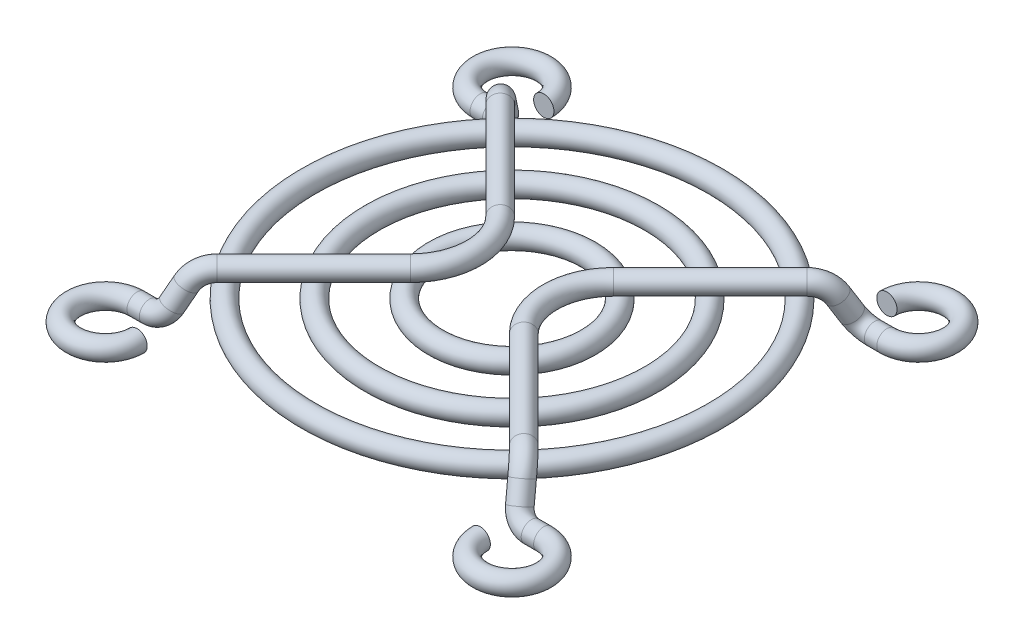
ISO-10303-21;
HEADER;
FILE_DESCRIPTION(('STEP AP214'),'2;1');
FILE_NAME('part.step','',(''),(''),'','','');
FILE_SCHEMA(('AUTOMOTIVE_DESIGN { 1 0 10303 214 1 1 1 1 }'));
ENDSEC;
DATA;
#1=APPLICATION_CONTEXT('core data for automotive mechanical design processes');
#2=APPLICATION_PROTOCOL_DEFINITION('international standard','automotive_design',2000,#1);
#3=PRODUCT_CONTEXT('',#1,'mechanical');
#4=PRODUCT('Part','Part','',(#3));
#5=PRODUCT_RELATED_PRODUCT_CATEGORY('part','',(#4));
#6=PRODUCT_DEFINITION_FORMATION('','',#4);
#7=PRODUCT_DEFINITION_CONTEXT('part definition',#1,'design');
#8=PRODUCT_DEFINITION('design','',#6,#7);
#9=PRODUCT_DEFINITION_SHAPE('','',#8);
#10=(LENGTH_UNIT() NAMED_UNIT(*) SI_UNIT(.MILLI.,.METRE.));
#11=(NAMED_UNIT(*) PLANE_ANGLE_UNIT() SI_UNIT($,.RADIAN.));
#12=(NAMED_UNIT(*) SI_UNIT($,.STERADIAN.) SOLID_ANGLE_UNIT());
#13=UNCERTAINTY_MEASURE_WITH_UNIT(LENGTH_MEASURE(1.E-05),#10,'distance_accuracy_value','');
#14=(GEOMETRIC_REPRESENTATION_CONTEXT(3) GLOBAL_UNCERTAINTY_ASSIGNED_CONTEXT((#13)) GLOBAL_UNIT_ASSIGNED_CONTEXT((#10,
#11,#12)) REPRESENTATION_CONTEXT('',''));
#15=CARTESIAN_POINT('',(0.,0.,0.));
#16=DIRECTION('',(0.,0.,1.));
#17=DIRECTION('',(1.,0.,0.));
#18=AXIS2_PLACEMENT_3D('',#15,#16,#17);
#19=CARTESIAN_POINT('',(16.,-1.6,-16.));
#20=DIRECTION('',(0.,-1.,0.));
#21=DIRECTION('',(0.,0.,-1.));
#22=AXIS2_PLACEMENT_3D('',#19,#20,#21);
#23=TOROIDAL_SURFACE('',#22,2.5,0.799999999999999);
#24=CARTESIAN_POINT('',(13.5,-1.6,-15.9999999999999));
#25=DIRECTION('',(0.,0.,-1.));
#26=DIRECTION('',(-1.,0.,0.));
#27=AXIS2_PLACEMENT_3D('',#24,#25,#26);
#28=CIRCLE('',#27,0.799999999999999);
#29=CARTESIAN_POINT('',(12.7,-1.6,-15.9999999999999));
#30=VERTEX_POINT('',#29);
#31=EDGE_CURVE('E11',#30,#30,#28,.T.);
#32=CARTESIAN_POINT('',(16.,-1.6,-13.5));
#33=DIRECTION('',(-1.,0.,0.));
#34=DIRECTION('',(0.,0.,1.));
#35=AXIS2_PLACEMENT_3D('',#32,#33,#34);
#36=CIRCLE('',#35,0.799999999999999);
#37=CARTESIAN_POINT('',(16.,-1.6,-12.7));
#38=VERTEX_POINT('',#37);
#39=EDGE_CURVE('E49',#38,#38,#36,.T.);
#40=CARTESIAN_POINT('',(16.,-1.6,-16.));
#41=DIRECTION('',(0.,-1.,0.));
#42=DIRECTION('',(0.,0.,-1.));
#43=AXIS2_PLACEMENT_3D('',#40,#41,#42);
#44=CIRCLE('',#43,3.3);
#45=EDGE_CURVE('',#30,#38,#44,.T.);
#46=ORIENTED_EDGE('',*,*,#31,.T.);
#47=ORIENTED_EDGE('',*,*,#39,.F.);
#48=ORIENTED_EDGE('',*,*,#45,.T.);
#49=ORIENTED_EDGE('',*,*,#45,.F.);
#50=EDGE_LOOP('',(#46,#48,#47,#49));
#51=FACE_BOUND('',#50,.T.);
#52=ADVANCED_FACE('F43',(#51),#23,.T.);
#53=CARTESIAN_POINT('',(15.0241205850169,-1.6,-13.5));
#54=DIRECTION('',(1.,0.,0.));
#55=DIRECTION('',(0.,0.,1.));
#56=AXIS2_PLACEMENT_3D('',#53,#54,#55);
#57=CYLINDRICAL_SURFACE('',#56,0.799999999999999);
#58=CARTESIAN_POINT('',(15.0241205850169,-1.6,-13.5));
#59=DIRECTION('',(-1.,0.,0.));
#60=DIRECTION('',(0.,0.,1.));
#61=AXIS2_PLACEMENT_3D('',#58,#59,#60);
#62=CIRCLE('',#61,0.799999999999999);
#63=CARTESIAN_POINT('',(15.0241205850169,-2.31908639541689,-13.8505920077902));
#64=VERTEX_POINT('',#63);
#65=EDGE_CURVE('E53',#64,#64,#62,.T.);
#66=ORIENTED_EDGE('',*,*,#65,.F.);
#67=EDGE_LOOP('',(#66));
#68=FACE_BOUND('',#67,.T.);
#69=ORIENTED_EDGE('',*,*,#39,.T.);
#70=EDGE_LOOP('',(#69));
#71=FACE_BOUND('',#70,.T.);
#72=ADVANCED_FACE('F111',(#68,#71),#57,.T.);
#73=CARTESIAN_POINT('',(15.0241205850169,-0.341598808020452,-12.8864639863672));
#74=DIRECTION('',(0.,0.43824000973773,-0.898857994271105));
#75=DIRECTION('',(0.,0.898857994271105,0.43824000973773));
#76=AXIS2_PLACEMENT_3D('',#73,#74,#75);
#77=TOROIDAL_SURFACE('',#76,1.4,0.799999999999999);
#78=CARTESIAN_POINT('',(13.6898604009678,-0.722686784194421,-13.0722641900187));
#79=DIRECTION('',(-0.30283504068719,0.856650309192963,0.417661568607395));
#80=DIRECTION('',(0.41766156860738,-0.274624108741221,0.866106467477592));
#81=AXIS2_PLACEMENT_3D('',#78,#79,#80);
#82=CIRCLE('',#81,0.799999999999999);
#83=CARTESIAN_POINT('',(12.9274260100826,-0.940451342008117,-13.1784357349625));
#84=VERTEX_POINT('',#83);
#85=EDGE_CURVE('E57',#84,#84,#82,.T.);
#86=CARTESIAN_POINT('',(15.0241205850169,-0.341598808020452,-12.8864639863672));
#87=DIRECTION('',(0.,0.43824000973773,-0.898857994271105));
#88=DIRECTION('',(0.,0.898857994271105,0.43824000973773));
#89=AXIS2_PLACEMENT_3D('',#86,#87,#88);
#90=CIRCLE('',#89,2.2);
#91=EDGE_CURVE('',#64,#84,#90,.T.);
#92=ORIENTED_EDGE('',*,*,#65,.T.);
#93=ORIENTED_EDGE('',*,*,#85,.F.);
#94=ORIENTED_EDGE('',*,*,#91,.T.);
#95=ORIENTED_EDGE('',*,*,#91,.F.);
#96=EDGE_LOOP('',(#92,#94,#93,#95));
#97=FACE_BOUND('',#96,.T.);
#98=ADVANCED_FACE('F116',(#97),#77,.T.);
#99=CARTESIAN_POINT('',(13.2140349780792,0.62331331775687,-12.416019152932));
#100=DIRECTION('',(0.302835040687196,-0.856650309192966,-0.417661568607382));
#101=DIRECTION('',(0.,0.43824000973773,-0.898857994271105));
#102=AXIS2_PLACEMENT_3D('',#99,#100,#101);
#103=CYLINDRICAL_SURFACE('',#102,0.799999999999999);
#104=CARTESIAN_POINT('',(13.2140349780792,0.62331331775687,-12.416019152932));
#105=DIRECTION('',(-0.30283504068719,0.856650309192963,0.417661568607395));
#106=DIRECTION('',(0.41766156860738,-0.274624108741221,0.866106467477592));
#107=AXIS2_PLACEMENT_3D('',#104,#105,#106);
#108=CIRCLE('',#107,0.799999999999999);
#109=CARTESIAN_POINT('',(13.7279954207643,1.02906926174901,-12.8755915381664));
#110=VERTEX_POINT('',#109);
#111=EDGE_CURVE('E62',#110,#110,#108,.T.);
#112=ORIENTED_EDGE('',*,*,#111,.F.);
#113=EDGE_LOOP('',(#112));
#114=FACE_BOUND('',#113,.T.);
#115=ORIENTED_EDGE('',*,*,#85,.T.);
#116=EDGE_LOOP('',(#115));
#117=FACE_BOUND('',#116,.T.);
#118=ADVANCED_FACE('F121',(#114,#117),#103,.T.);
#119=CARTESIAN_POINT('',(11.9291338713665,-0.391076542223485,-11.2670881898462));
#120=DIRECTION('',(0.703951862433849,-0.0943586283910578,0.703951862433841));
#121=DIRECTION('',(-0.707106781186544,0.,0.707106781186551));
#122=AXIS2_PLACEMENT_3D('',#119,#120,#121);
#123=TOROIDAL_SURFACE('',#122,2.,0.799999999999999);
#124=CARTESIAN_POINT('',(12.0625771233641,1.6,-11.1336449378486));
#125=DIRECTION('',(-0.707106781186535,0.,0.707106781186561));
#126=DIRECTION('',(0.629823043352769,-0.454583180643264,0.629823043352742));
#127=AXIS2_PLACEMENT_3D('',#124,#125,#126);
#128=CIRCLE('',#127,0.799999999999999);
#129=CARTESIAN_POINT('',(12.1159544241631,2.3964306168894,-11.0802676370496));
#130=VERTEX_POINT('',#129);
#131=EDGE_CURVE('E65',#130,#130,#128,.T.);
#132=CARTESIAN_POINT('',(11.9291338713665,-0.391076542223485,-11.2670881898462));
#133=DIRECTION('',(0.703951862433849,-0.0943586283910578,0.703951862433841));
#134=DIRECTION('',(-0.707106781186544,0.,0.707106781186551));
#135=AXIS2_PLACEMENT_3D('',#132,#133,#134);
#136=CIRCLE('',#135,2.8);
#137=EDGE_CURVE('',#110,#130,#136,.T.);
#138=ORIENTED_EDGE('',*,*,#111,.T.);
#139=ORIENTED_EDGE('',*,*,#131,.F.);
#140=ORIENTED_EDGE('',*,*,#137,.T.);
#141=ORIENTED_EDGE('',*,*,#137,.F.);
#142=EDGE_LOOP('',(#138,#140,#139,#141));
#143=FACE_BOUND('',#142,.T.);
#144=ADVANCED_FACE('F128',(#143),#123,.T.);
#145=CARTESIAN_POINT('',(4.46446609275775,1.6,-3.53553390724226));
#146=DIRECTION('',(0.707106781186544,0.,-0.707106781186551));
#147=DIRECTION('',(0.707106781186551,0.,0.707106781186544));
#148=AXIS2_PLACEMENT_3D('',#145,#146,#147);
#149=CYLINDRICAL_SURFACE('',#148,0.799999999999999);
#150=CARTESIAN_POINT('',(4.46446609275775,1.6,-3.53553390724226));
#151=DIRECTION('',(-0.707106781186535,0.,0.707106781186561));
#152=DIRECTION('',(0.629823043352769,-0.454583180643264,0.629823043352742));
#153=AXIS2_PLACEMENT_3D('',#150,#151,#152);
#154=CIRCLE('',#153,0.799999999999999);
#155=CARTESIAN_POINT('',(3.89878066780852,1.6,-4.10121933219149));
#156=VERTEX_POINT('',#155);
#157=EDGE_CURVE('E68',#156,#156,#154,.T.);
#158=ORIENTED_EDGE('',*,*,#157,.F.);
#159=EDGE_LOOP('',(#158));
#160=FACE_BOUND('',#159,.T.);
#161=ORIENTED_EDGE('',*,*,#131,.T.);
#162=EDGE_LOOP('',(#161));
#163=FACE_BOUND('',#162,.T.);
#164=ADVANCED_FACE('F132',(#160,#163),#149,.T.);
#165=CARTESIAN_POINT('',(8.,1.6,0.));
#166=DIRECTION('',(0.,1.,0.));
#167=DIRECTION('',(0.,0.,1.));
#168=AXIS2_PLACEMENT_3D('',#165,#166,#167);
#169=TOROIDAL_SURFACE('',#168,5.00000000185193,0.799999999999999);
#170=CARTESIAN_POINT('',(4.46446609275775,1.6,3.53553390724226));
#171=DIRECTION('',(0.707106781186562,0.,0.707106781186534));
#172=DIRECTION('',(0.629823043352741,-0.454583180643264,-0.62982304335277));
#173=AXIS2_PLACEMENT_3D('',#170,#171,#172);
#174=CIRCLE('',#173,0.799999999999999);
#175=CARTESIAN_POINT('',(3.89878066780852,1.6,4.10121933219149));
#176=VERTEX_POINT('',#175);
#177=EDGE_CURVE('E71',#176,#176,#174,.T.);
#178=CARTESIAN_POINT('',(8.,1.6,0.));
#179=DIRECTION('',(0.,1.,0.));
#180=DIRECTION('',(0.,0.,1.));
#181=AXIS2_PLACEMENT_3D('',#178,#179,#180);
#182=CIRCLE('',#181,5.80000000185193);
#183=EDGE_CURVE('',#156,#176,#182,.T.);
#184=ORIENTED_EDGE('',*,*,#157,.T.);
#185=ORIENTED_EDGE('',*,*,#177,.F.);
#186=ORIENTED_EDGE('',*,*,#183,.T.);
#187=ORIENTED_EDGE('',*,*,#183,.F.);
#188=EDGE_LOOP('',(#184,#186,#185,#187));
#189=FACE_BOUND('',#188,.T.);
#190=ADVANCED_FACE('F136',(#189),#169,.T.);
#191=CARTESIAN_POINT('',(12.0625771233642,1.6,11.1336449378485));
#192=DIRECTION('',(-0.707106781186554,0.,-0.707106781186541));
#193=DIRECTION('',(0.707106781186541,0.,-0.707106781186554));
#194=AXIS2_PLACEMENT_3D('',#191,#192,#193);
#195=CYLINDRICAL_SURFACE('',#194,0.799999999999999);
#196=CARTESIAN_POINT('',(12.0625771233642,1.6,11.1336449378485));
#197=DIRECTION('',(0.707106781186562,0.,0.707106781186534));
#198=DIRECTION('',(0.629823043352741,-0.454583180643264,-0.62982304335277));
#199=AXIS2_PLACEMENT_3D('',#196,#197,#198);
#200=CIRCLE('',#199,0.799999999999999);
#201=CARTESIAN_POINT('',(12.1159544241632,2.39643061688939,11.0802676370495));
#202=VERTEX_POINT('',#201);
#203=EDGE_CURVE('E74',#202,#202,#200,.T.);
#204=ORIENTED_EDGE('',*,*,#203,.F.);
#205=EDGE_LOOP('',(#204));
#206=FACE_BOUND('',#205,.T.);
#207=ORIENTED_EDGE('',*,*,#177,.T.);
#208=EDGE_LOOP('',(#207));
#209=FACE_BOUND('',#208,.T.);
#210=ADVANCED_FACE('F140',(#206,#209),#195,.T.);
#211=CARTESIAN_POINT('',(11.9291338713666,-0.391076542223475,11.2670881898462));
#212=DIRECTION('',(0.703951862433834,-0.0943586283911166,-0.703951862433848));
#213=DIRECTION('',(0.707106781186554,0.,0.707106781186541));
#214=AXIS2_PLACEMENT_3D('',#211,#212,#213);
#215=TOROIDAL_SURFACE('',#214,2.,0.799999999999999);
#216=CARTESIAN_POINT('',(13.2140349780794,0.623313317756879,12.416019152932));
#217=DIRECTION('',(0.302835040687154,-0.856650309192979,0.417661568607388));
#218=DIRECTION('',(0.417661568607394,-0.274624108741218,-0.866106467477586));
#219=AXIS2_PLACEMENT_3D('',#216,#217,#218);
#220=CIRCLE('',#219,0.799999999999999);
#221=CARTESIAN_POINT('',(13.7279954207645,1.02906926174902,12.8755915381663));
#222=VERTEX_POINT('',#221);
#223=EDGE_CURVE('E77',#222,#222,#220,.T.);
#224=CARTESIAN_POINT('',(11.9291338713666,-0.391076542223475,11.2670881898462));
#225=DIRECTION('',(0.703951862433834,-0.0943586283911166,-0.703951862433848));
#226=DIRECTION('',(0.707106781186554,0.,0.707106781186541));
#227=AXIS2_PLACEMENT_3D('',#224,#225,#226);
#228=CIRCLE('',#227,2.8);
#229=EDGE_CURVE('',#202,#222,#228,.T.);
#230=ORIENTED_EDGE('',*,*,#203,.T.);
#231=ORIENTED_EDGE('',*,*,#223,.F.);
#232=ORIENTED_EDGE('',*,*,#229,.T.);
#233=ORIENTED_EDGE('',*,*,#229,.F.);
#234=EDGE_LOOP('',(#230,#232,#231,#233));
#235=FACE_BOUND('',#234,.T.);
#236=ADVANCED_FACE('F144',(#235),#215,.T.);
#237=CARTESIAN_POINT('',(13.6898604009678,-0.72268678419431,13.0722641900187));
#238=DIRECTION('',(-0.30283504068715,0.856650309192975,-0.4176615686074));
#239=DIRECTION('',(0.,0.438240009737742,0.8988579942711));
#240=AXIS2_PLACEMENT_3D('',#237,#238,#239);
#241=CYLINDRICAL_SURFACE('',#240,0.799999999999999);
#242=CARTESIAN_POINT('',(13.6898604009678,-0.72268678419431,13.0722641900187));
#243=DIRECTION('',(0.302835040687154,-0.856650309192979,0.417661568607388));
#244=DIRECTION('',(0.417661568607394,-0.274624108741218,-0.866106467477586));
#245=AXIS2_PLACEMENT_3D('',#242,#243,#244);
#246=CIRCLE('',#245,0.799999999999999);
#247=CARTESIAN_POINT('',(12.9274260100826,-0.94045134200794,13.1784357349624));
#248=VERTEX_POINT('',#247);
#249=EDGE_CURVE('E80',#248,#248,#246,.T.);
#250=ORIENTED_EDGE('',*,*,#249,.F.);
#251=EDGE_LOOP('',(#250));
#252=FACE_BOUND('',#251,.T.);
#253=ORIENTED_EDGE('',*,*,#223,.T.);
#254=EDGE_LOOP('',(#253));
#255=FACE_BOUND('',#254,.T.);
#256=ADVANCED_FACE('F148',(#252,#255),#241,.T.);
#257=CARTESIAN_POINT('',(15.0241205850169,-0.341598808020458,12.8864639863672));
#258=DIRECTION('',(0.,0.43824000973774,0.898857994271101));
#259=DIRECTION('',(0.,-0.898857994271101,0.43824000973774));
#260=AXIS2_PLACEMENT_3D('',#257,#258,#259);
#261=TOROIDAL_SURFACE('',#260,1.4,0.799999999999999);
#262=CARTESIAN_POINT('',(15.0241205850169,-1.6,13.5));
#263=DIRECTION('',(1.,0.,0.));
#264=DIRECTION('',(0.,0.,-1.));
#265=AXIS2_PLACEMENT_3D('',#262,#263,#264);
#266=CIRCLE('',#265,0.799999999999999);
#267=CARTESIAN_POINT('',(15.0241205850169,-2.31908639541688,13.8505920077902));
#268=VERTEX_POINT('',#267);
#269=EDGE_CURVE('E83',#268,#268,#266,.T.);
#270=CARTESIAN_POINT('',(15.0241205850169,-0.341598808020458,12.8864639863672));
#271=DIRECTION('',(0.,0.43824000973774,0.898857994271101));
#272=DIRECTION('',(0.,-0.898857994271101,0.43824000973774));
#273=AXIS2_PLACEMENT_3D('',#270,#271,#272);
#274=CIRCLE('',#273,2.2);
#275=EDGE_CURVE('',#248,#268,#274,.T.);
#276=ORIENTED_EDGE('',*,*,#249,.T.);
#277=ORIENTED_EDGE('',*,*,#269,.F.);
#278=ORIENTED_EDGE('',*,*,#275,.T.);
#279=ORIENTED_EDGE('',*,*,#275,.F.);
#280=EDGE_LOOP('',(#276,#278,#277,#279));
#281=FACE_BOUND('',#280,.T.);
#282=ADVANCED_FACE('F107',(#281),#261,.T.);
#283=CARTESIAN_POINT('',(16.,-1.6,13.5));
#284=DIRECTION('',(-1.,0.,0.));
#285=DIRECTION('',(0.,1.,0.));
#286=AXIS2_PLACEMENT_3D('',#283,#284,#285);
#287=CYLINDRICAL_SURFACE('',#286,0.799999999999999);
#288=CARTESIAN_POINT('',(16.,-1.6,13.5));
#289=DIRECTION('',(1.,0.,0.));
#290=DIRECTION('',(0.,0.,-1.));
#291=AXIS2_PLACEMENT_3D('',#288,#289,#290);
#292=CIRCLE('',#291,0.799999999999999);
#293=CARTESIAN_POINT('',(16.,-1.6,12.7));
#294=VERTEX_POINT('',#293);
#295=EDGE_CURVE('E86',#294,#294,#292,.T.);
#296=ORIENTED_EDGE('',*,*,#295,.F.);
#297=EDGE_LOOP('',(#296));
#298=FACE_BOUND('',#297,.T.);
#299=ORIENTED_EDGE('',*,*,#269,.T.);
#300=EDGE_LOOP('',(#299));
#301=FACE_BOUND('',#300,.T.);
#302=ADVANCED_FACE('F98',(#298,#301),#287,.T.);
#303=CARTESIAN_POINT('',(16.,-1.6,16.));
#304=DIRECTION('',(0.,1.,0.));
#305=DIRECTION('',(0.,0.,1.));
#306=AXIS2_PLACEMENT_3D('',#303,#304,#305);
#307=TOROIDAL_SURFACE('',#306,2.5,0.799999999999999);
#308=CARTESIAN_POINT('',(13.5,-1.6,16.));
#309=DIRECTION('',(0.,0.,-1.));
#310=DIRECTION('',(-1.,0.,0.));
#311=AXIS2_PLACEMENT_3D('',#308,#309,#310);
#312=CIRCLE('',#311,0.799999999999999);
#313=CARTESIAN_POINT('',(12.7,-1.6,16.));
#314=VERTEX_POINT('',#313);
#315=EDGE_CURVE('E89',#314,#314,#312,.T.);
#316=CARTESIAN_POINT('',(16.,-1.6,16.));
#317=DIRECTION('',(0.,1.,0.));
#318=DIRECTION('',(0.,0.,1.));
#319=AXIS2_PLACEMENT_3D('',#316,#317,#318);
#320=CIRCLE('',#319,3.3);
#321=EDGE_CURVE('',#314,#294,#320,.T.);
#322=ORIENTED_EDGE('',*,*,#315,.F.);
#323=ORIENTED_EDGE('',*,*,#295,.T.);
#324=ORIENTED_EDGE('',*,*,#321,.T.);
#325=ORIENTED_EDGE('',*,*,#321,.F.);
#326=EDGE_LOOP('',(#322,#324,#323,#325));
#327=FACE_BOUND('',#326,.T.);
#328=ADVANCED_FACE('F95',(#327),#307,.T.);
#329=CARTESIAN_POINT('',(13.5,-1.6,-15.9999999999999));
#330=DIRECTION('',(0.,0.,1.));
#331=DIRECTION('',(-1.,0.,0.));
#332=AXIS2_PLACEMENT_3D('',#329,#330,#331);
#333=PLANE('',#332);
#334=ORIENTED_EDGE('',*,*,#31,.F.);
#335=EDGE_LOOP('',(#334));
#336=FACE_BOUND('',#335,.T.);
#337=ADVANCED_FACE('F97',(#336),#333,.T.);
#338=CARTESIAN_POINT('',(13.5,-1.6,16.));
#339=DIRECTION('',(0.,0.,1.));
#340=DIRECTION('',(-1.,0.,0.));
#341=AXIS2_PLACEMENT_3D('',#338,#339,#340);
#342=PLANE('',#341);
#343=ORIENTED_EDGE('',*,*,#315,.T.);
#344=EDGE_LOOP('',(#343));
#345=FACE_BOUND('',#344,.T.);
#346=ADVANCED_FACE('F93',(#345),#342,.F.);
#347=CLOSED_SHELL('',(#52,#72,#98,#118,#144,#164,#190,#210,#236,#256,#282,#302,#328,#337,#346));
#348=MANIFOLD_SOLID_BREP('B2',#347);
#349=CARTESIAN_POINT('',(-16.,-1.6,-16.));
#350=DIRECTION('',(0.,-1.,0.));
#351=DIRECTION('',(0.,0.,-1.));
#352=AXIS2_PLACEMENT_3D('',#349,#350,#351);
#353=TOROIDAL_SURFACE('',#352,2.5,0.799999999999999);
#354=CARTESIAN_POINT('',(-16.,-1.6,-13.5));
#355=DIRECTION('',(-1.,0.,0.));
#356=DIRECTION('',(0.,0.,1.));
#357=AXIS2_PLACEMENT_3D('',#354,#355,#356);
#358=CIRCLE('',#357,0.799999999999999);
#359=CARTESIAN_POINT('',(-16.,-1.6,-12.7));
#360=VERTEX_POINT('',#359);
#361=EDGE_CURVE('E275',#360,#360,#358,.T.);
#362=CARTESIAN_POINT('',(-13.5,-1.6,-15.9999999999999));
#363=DIRECTION('',(0.,0.,1.));
#364=DIRECTION('',(1.,0.,0.));
#365=AXIS2_PLACEMENT_3D('',#362,#363,#364);
#366=CIRCLE('',#365,0.799999999999999);
#367=CARTESIAN_POINT('',(-12.7,-1.6,-15.9999999999999));
#368=VERTEX_POINT('',#367);
#369=EDGE_CURVE('E42',#368,#368,#366,.T.);
#370=CARTESIAN_POINT('',(-16.,-1.6,-16.));
#371=DIRECTION('',(0.,-1.,0.));
#372=DIRECTION('',(0.,0.,-1.));
#373=AXIS2_PLACEMENT_3D('',#370,#371,#372);
#374=CIRCLE('',#373,3.3);
#375=EDGE_CURVE('',#360,#368,#374,.T.);
#376=ORIENTED_EDGE('',*,*,#361,.T.);
#377=ORIENTED_EDGE('',*,*,#369,.F.);
#378=ORIENTED_EDGE('',*,*,#375,.T.);
#379=ORIENTED_EDGE('',*,*,#375,.F.);
#380=EDGE_LOOP('',(#376,#378,#377,#379));
#381=FACE_BOUND('',#380,.T.);
#382=ADVANCED_FACE('F269',(#381),#353,.T.);
#383=CARTESIAN_POINT('',(-15.0241205850169,-1.6,-13.5));
#384=DIRECTION('',(-1.,0.,0.));
#385=DIRECTION('',(0.,0.,1.));
#386=AXIS2_PLACEMENT_3D('',#383,#384,#385);
#387=CYLINDRICAL_SURFACE('',#386,0.799999999999999);
#388=CARTESIAN_POINT('',(-15.0241205850169,-1.6,-13.5));
#389=DIRECTION('',(-1.,0.,0.));
#390=DIRECTION('',(0.,0.,1.));
#391=AXIS2_PLACEMENT_3D('',#388,#389,#390);
#392=CIRCLE('',#391,0.799999999999999);
#393=CARTESIAN_POINT('',(-15.0241205850169,-2.31908639541689,-13.8505920077902));
#394=VERTEX_POINT('',#393);
#395=EDGE_CURVE('E279',#394,#394,#392,.T.);
#396=ORIENTED_EDGE('',*,*,#395,.T.);
#397=EDGE_LOOP('',(#396));
#398=FACE_BOUND('',#397,.T.);
#399=ORIENTED_EDGE('',*,*,#361,.F.);
#400=EDGE_LOOP('',(#399));
#401=FACE_BOUND('',#400,.T.);
#402=ADVANCED_FACE('F330',(#398,#401),#387,.T.);
#403=CARTESIAN_POINT('',(-15.0241205850169,-0.341598808020452,-12.8864639863672));
#404=DIRECTION('',(0.,0.43824000973773,-0.898857994271105));
#405=DIRECTION('',(0.,0.898857994271105,0.43824000973773));
#406=AXIS2_PLACEMENT_3D('',#403,#404,#405);
#407=TOROIDAL_SURFACE('',#406,1.4,0.799999999999999);
#408=CARTESIAN_POINT('',(-13.6898604009678,-0.722686784194421,-13.0722641900187));
#409=DIRECTION('',(-0.30283504068719,-0.856650309192963,-0.417661568607395));
#410=DIRECTION('',(-0.41766156860738,-0.274624108741221,0.866106467477592));
#411=AXIS2_PLACEMENT_3D('',#408,#409,#410);
#412=CIRCLE('',#411,0.799999999999999);
#413=CARTESIAN_POINT('',(-12.9274260100826,-0.940451342008117,-13.1784357349625));
#414=VERTEX_POINT('',#413);
#415=EDGE_CURVE('E283',#414,#414,#412,.T.);
#416=CARTESIAN_POINT('',(-15.0241205850169,-0.341598808020452,-12.8864639863672));
#417=DIRECTION('',(0.,0.43824000973773,-0.898857994271105));
#418=DIRECTION('',(0.,0.898857994271105,0.43824000973773));
#419=AXIS2_PLACEMENT_3D('',#416,#417,#418);
#420=CIRCLE('',#419,2.2);
#421=EDGE_CURVE('',#414,#394,#420,.T.);
#422=ORIENTED_EDGE('',*,*,#415,.T.);
#423=ORIENTED_EDGE('',*,*,#395,.F.);
#424=ORIENTED_EDGE('',*,*,#421,.T.);
#425=ORIENTED_EDGE('',*,*,#421,.F.);
#426=EDGE_LOOP('',(#422,#424,#423,#425));
#427=FACE_BOUND('',#426,.T.);
#428=ADVANCED_FACE('F334',(#427),#407,.T.);
#429=CARTESIAN_POINT('',(-13.2140349780792,0.62331331775687,-12.416019152932));
#430=DIRECTION('',(-0.302835040687196,-0.856650309192966,-0.417661568607382));
#431=DIRECTION('',(0.,0.43824000973773,-0.898857994271105));
#432=AXIS2_PLACEMENT_3D('',#429,#430,#431);
#433=CYLINDRICAL_SURFACE('',#432,0.799999999999999);
#434=CARTESIAN_POINT('',(-13.2140349780792,0.62331331775687,-12.416019152932));
#435=DIRECTION('',(-0.30283504068719,-0.856650309192963,-0.417661568607395));
#436=DIRECTION('',(-0.41766156860738,-0.274624108741221,0.866106467477592));
#437=AXIS2_PLACEMENT_3D('',#434,#435,#436);
#438=CIRCLE('',#437,0.799999999999999);
#439=CARTESIAN_POINT('',(-13.7279954207643,1.02906926174901,-12.8755915381664));
#440=VERTEX_POINT('',#439);
#441=EDGE_CURVE('E288',#440,#440,#438,.T.);
#442=ORIENTED_EDGE('',*,*,#441,.T.);
#443=EDGE_LOOP('',(#442));
#444=FACE_BOUND('',#443,.T.);
#445=ORIENTED_EDGE('',*,*,#415,.F.);
#446=EDGE_LOOP('',(#445));
#447=FACE_BOUND('',#446,.T.);
#448=ADVANCED_FACE('F340',(#444,#447),#433,.T.);
#449=CARTESIAN_POINT('',(-11.9291338713665,-0.391076542223485,-11.2670881898462));
#450=DIRECTION('',(-0.703951862433849,-0.0943586283910578,0.703951862433841));
#451=DIRECTION('',(0.707106781186544,0.,0.707106781186551));
#452=AXIS2_PLACEMENT_3D('',#449,#450,#451);
#453=TOROIDAL_SURFACE('',#452,2.,0.799999999999999);
#454=CARTESIAN_POINT('',(-12.0625771233641,1.6,-11.1336449378486));
#455=DIRECTION('',(-0.707106781186535,0.,-0.707106781186561));
#456=DIRECTION('',(-0.629823043352769,-0.454583180643264,0.629823043352742));
#457=AXIS2_PLACEMENT_3D('',#454,#455,#456);
#458=CIRCLE('',#457,0.799999999999999);
#459=CARTESIAN_POINT('',(-12.1159544241631,2.3964306168894,-11.0802676370496));
#460=VERTEX_POINT('',#459);
#461=EDGE_CURVE('E291',#460,#460,#458,.T.);
#462=CARTESIAN_POINT('',(-11.9291338713665,-0.391076542223485,-11.2670881898462));
#463=DIRECTION('',(-0.703951862433849,-0.0943586283910578,0.703951862433841));
#464=DIRECTION('',(0.707106781186544,0.,0.707106781186551));
#465=AXIS2_PLACEMENT_3D('',#462,#463,#464);
#466=CIRCLE('',#465,2.8);
#467=EDGE_CURVE('',#460,#440,#466,.T.);
#468=ORIENTED_EDGE('',*,*,#461,.T.);
#469=ORIENTED_EDGE('',*,*,#441,.F.);
#470=ORIENTED_EDGE('',*,*,#467,.T.);
#471=ORIENTED_EDGE('',*,*,#467,.F.);
#472=EDGE_LOOP('',(#468,#470,#469,#471));
#473=FACE_BOUND('',#472,.T.);
#474=ADVANCED_FACE('F347',(#473),#453,.T.);
#475=CARTESIAN_POINT('',(-4.46446609275775,1.6,-3.53553390724226));
#476=DIRECTION('',(-0.707106781186544,0.,-0.707106781186551));
#477=DIRECTION('',(-0.707106781186551,0.,0.707106781186544));
#478=AXIS2_PLACEMENT_3D('',#475,#476,#477);
#479=CYLINDRICAL_SURFACE('',#478,0.799999999999999);
#480=CARTESIAN_POINT('',(-4.46446609275775,1.6,-3.53553390724226));
#481=DIRECTION('',(-0.707106781186535,0.,-0.707106781186561));
#482=DIRECTION('',(-0.629823043352769,-0.454583180643264,0.629823043352742));
#483=AXIS2_PLACEMENT_3D('',#480,#481,#482);
#484=CIRCLE('',#483,0.799999999999999);
#485=CARTESIAN_POINT('',(-3.89878066780852,1.6,-4.10121933219149));
#486=VERTEX_POINT('',#485);
#487=EDGE_CURVE('E294',#486,#486,#484,.T.);
#488=ORIENTED_EDGE('',*,*,#487,.T.);
#489=EDGE_LOOP('',(#488));
#490=FACE_BOUND('',#489,.T.);
#491=ORIENTED_EDGE('',*,*,#461,.F.);
#492=EDGE_LOOP('',(#491));
#493=FACE_BOUND('',#492,.T.);
#494=ADVANCED_FACE('F351',(#490,#493),#479,.T.);
#495=CARTESIAN_POINT('',(-8.,1.6,0.));
#496=DIRECTION('',(0.,1.,0.));
#497=DIRECTION('',(0.,0.,1.));
#498=AXIS2_PLACEMENT_3D('',#495,#496,#497);
#499=TOROIDAL_SURFACE('',#498,5.00000000185193,0.799999999999999);
#500=CARTESIAN_POINT('',(-4.46446609275775,1.6,3.53553390724226));
#501=DIRECTION('',(0.707106781186562,0.,-0.707106781186534));
#502=DIRECTION('',(-0.629823043352741,-0.454583180643264,-0.62982304335277));
#503=AXIS2_PLACEMENT_3D('',#500,#501,#502);
#504=CIRCLE('',#503,0.799999999999999);
#505=CARTESIAN_POINT('',(-3.89878066780852,1.6,4.10121933219149));
#506=VERTEX_POINT('',#505);
#507=EDGE_CURVE('E297',#506,#506,#504,.T.);
#508=CARTESIAN_POINT('',(-8.,1.6,0.));
#509=DIRECTION('',(0.,1.,0.));
#510=DIRECTION('',(0.,0.,1.));
#511=AXIS2_PLACEMENT_3D('',#508,#509,#510);
#512=CIRCLE('',#511,5.80000000185193);
#513=EDGE_CURVE('',#506,#486,#512,.T.);
#514=ORIENTED_EDGE('',*,*,#507,.T.);
#515=ORIENTED_EDGE('',*,*,#487,.F.);
#516=ORIENTED_EDGE('',*,*,#513,.T.);
#517=ORIENTED_EDGE('',*,*,#513,.F.);
#518=EDGE_LOOP('',(#514,#516,#515,#517));
#519=FACE_BOUND('',#518,.T.);
#520=ADVANCED_FACE('F355',(#519),#499,.T.);
#521=CARTESIAN_POINT('',(-12.0625771233642,1.6,11.1336449378485));
#522=DIRECTION('',(0.707106781186554,0.,-0.707106781186541));
#523=DIRECTION('',(-0.707106781186541,0.,-0.707106781186554));
#524=AXIS2_PLACEMENT_3D('',#521,#522,#523);
#525=CYLINDRICAL_SURFACE('',#524,0.799999999999999);
#526=CARTESIAN_POINT('',(-12.0625771233642,1.6,11.1336449378485));
#527=DIRECTION('',(0.707106781186562,0.,-0.707106781186534));
#528=DIRECTION('',(-0.629823043352741,-0.454583180643264,-0.62982304335277));
#529=AXIS2_PLACEMENT_3D('',#526,#527,#528);
#530=CIRCLE('',#529,0.799999999999999);
#531=CARTESIAN_POINT('',(-12.1159544241632,2.39643061688939,11.0802676370495));
#532=VERTEX_POINT('',#531);
#533=EDGE_CURVE('E300',#532,#532,#530,.T.);
#534=ORIENTED_EDGE('',*,*,#533,.T.);
#535=EDGE_LOOP('',(#534));
#536=FACE_BOUND('',#535,.T.);
#537=ORIENTED_EDGE('',*,*,#507,.F.);
#538=EDGE_LOOP('',(#537));
#539=FACE_BOUND('',#538,.T.);
#540=ADVANCED_FACE('F359',(#536,#539),#525,.T.);
#541=CARTESIAN_POINT('',(-11.9291338713666,-0.391076542223475,11.2670881898462));
#542=DIRECTION('',(-0.703951862433834,-0.0943586283911166,-0.703951862433848));
#543=DIRECTION('',(-0.707106781186554,0.,0.707106781186541));
#544=AXIS2_PLACEMENT_3D('',#541,#542,#543);
#545=TOROIDAL_SURFACE('',#544,2.,0.799999999999999);
#546=CARTESIAN_POINT('',(-13.2140349780794,0.623313317756879,12.416019152932));
#547=DIRECTION('',(0.302835040687154,0.856650309192979,-0.417661568607388));
#548=DIRECTION('',(-0.417661568607394,-0.274624108741218,-0.866106467477586));
#549=AXIS2_PLACEMENT_3D('',#546,#547,#548);
#550=CIRCLE('',#549,0.799999999999999);
#551=CARTESIAN_POINT('',(-13.7279954207645,1.02906926174902,12.8755915381663));
#552=VERTEX_POINT('',#551);
#553=EDGE_CURVE('E303',#552,#552,#550,.T.);
#554=CARTESIAN_POINT('',(-11.9291338713666,-0.391076542223475,11.2670881898462));
#555=DIRECTION('',(-0.703951862433834,-0.0943586283911166,-0.703951862433848));
#556=DIRECTION('',(-0.707106781186554,0.,0.707106781186541));
#557=AXIS2_PLACEMENT_3D('',#554,#555,#556);
#558=CIRCLE('',#557,2.8);
#559=EDGE_CURVE('',#552,#532,#558,.T.);
#560=ORIENTED_EDGE('',*,*,#553,.T.);
#561=ORIENTED_EDGE('',*,*,#533,.F.);
#562=ORIENTED_EDGE('',*,*,#559,.T.);
#563=ORIENTED_EDGE('',*,*,#559,.F.);
#564=EDGE_LOOP('',(#560,#562,#561,#563));
#565=FACE_BOUND('',#564,.T.);
#566=ADVANCED_FACE('F363',(#565),#545,.T.);
#567=CARTESIAN_POINT('',(-13.6898604009678,-0.72268678419431,13.0722641900187));
#568=DIRECTION('',(0.30283504068715,0.856650309192975,-0.4176615686074));
#569=DIRECTION('',(0.,0.438240009737742,0.8988579942711));
#570=AXIS2_PLACEMENT_3D('',#567,#568,#569);
#571=CYLINDRICAL_SURFACE('',#570,0.799999999999999);
#572=CARTESIAN_POINT('',(-13.6898604009678,-0.72268678419431,13.0722641900187));
#573=DIRECTION('',(0.302835040687154,0.856650309192979,-0.417661568607388));
#574=DIRECTION('',(-0.417661568607394,-0.274624108741218,-0.866106467477586));
#575=AXIS2_PLACEMENT_3D('',#572,#573,#574);
#576=CIRCLE('',#575,0.799999999999999);
#577=CARTESIAN_POINT('',(-12.9274260100826,-0.94045134200794,13.1784357349624));
#578=VERTEX_POINT('',#577);
#579=EDGE_CURVE('E306',#578,#578,#576,.T.);
#580=ORIENTED_EDGE('',*,*,#579,.T.);
#581=EDGE_LOOP('',(#580));
#582=FACE_BOUND('',#581,.T.);
#583=ORIENTED_EDGE('',*,*,#553,.F.);
#584=EDGE_LOOP('',(#583));
#585=FACE_BOUND('',#584,.T.);
#586=ADVANCED_FACE('F367',(#582,#585),#571,.T.);
#587=CARTESIAN_POINT('',(-15.0241205850169,-0.341598808020458,12.8864639863672));
#588=DIRECTION('',(0.,0.43824000973774,0.898857994271101));
#589=DIRECTION('',(0.,-0.898857994271101,0.43824000973774));
#590=AXIS2_PLACEMENT_3D('',#587,#588,#589);
#591=TOROIDAL_SURFACE('',#590,1.4,0.799999999999999);
#592=CARTESIAN_POINT('',(-15.0241205850169,-1.6,13.5));
#593=DIRECTION('',(1.,0.,0.));
#594=DIRECTION('',(0.,0.,-1.));
#595=AXIS2_PLACEMENT_3D('',#592,#593,#594);
#596=CIRCLE('',#595,0.799999999999999);
#597=CARTESIAN_POINT('',(-15.0241205850169,-2.31908639541688,13.8505920077902));
#598=VERTEX_POINT('',#597);
#599=EDGE_CURVE('E309',#598,#598,#596,.T.);
#600=CARTESIAN_POINT('',(-15.0241205850169,-0.341598808020458,12.8864639863672));
#601=DIRECTION('',(0.,0.43824000973774,0.898857994271101));
#602=DIRECTION('',(0.,-0.898857994271101,0.43824000973774));
#603=AXIS2_PLACEMENT_3D('',#600,#601,#602);
#604=CIRCLE('',#603,2.2);
#605=EDGE_CURVE('',#598,#578,#604,.T.);
#606=ORIENTED_EDGE('',*,*,#599,.T.);
#607=ORIENTED_EDGE('',*,*,#579,.F.);
#608=ORIENTED_EDGE('',*,*,#605,.T.);
#609=ORIENTED_EDGE('',*,*,#605,.F.);
#610=EDGE_LOOP('',(#606,#608,#607,#609));
#611=FACE_BOUND('',#610,.T.);
#612=ADVANCED_FACE('F371',(#611),#591,.T.);
#613=CARTESIAN_POINT('',(-16.,-1.6,13.5));
#614=DIRECTION('',(1.,0.,0.));
#615=DIRECTION('',(0.,1.,0.));
#616=AXIS2_PLACEMENT_3D('',#613,#614,#615);
#617=CYLINDRICAL_SURFACE('',#616,0.799999999999999);
#618=CARTESIAN_POINT('',(-16.,-1.6,13.5));
#619=DIRECTION('',(1.,0.,0.));
#620=DIRECTION('',(0.,0.,-1.));
#621=AXIS2_PLACEMENT_3D('',#618,#619,#620);
#622=CIRCLE('',#621,0.799999999999999);
#623=CARTESIAN_POINT('',(-16.,-1.6,12.7));
#624=VERTEX_POINT('',#623);
#625=EDGE_CURVE('E312',#624,#624,#622,.T.);
#626=ORIENTED_EDGE('',*,*,#625,.T.);
#627=EDGE_LOOP('',(#626));
#628=FACE_BOUND('',#627,.T.);
#629=ORIENTED_EDGE('',*,*,#599,.F.);
#630=EDGE_LOOP('',(#629));
#631=FACE_BOUND('',#630,.T.);
#632=ADVANCED_FACE('F375',(#628,#631),#617,.T.);
#633=CARTESIAN_POINT('',(-16.,-1.6,16.));
#634=DIRECTION('',(0.,1.,0.));
#635=DIRECTION('',(0.,0.,1.));
#636=AXIS2_PLACEMENT_3D('',#633,#634,#635);
#637=TOROIDAL_SURFACE('',#636,2.5,0.799999999999999);
#638=CARTESIAN_POINT('',(-13.5,-1.6,16.));
#639=DIRECTION('',(0.,0.,1.));
#640=DIRECTION('',(1.,0.,0.));
#641=AXIS2_PLACEMENT_3D('',#638,#639,#640);
#642=CIRCLE('',#641,0.799999999999999);
#643=CARTESIAN_POINT('',(-12.7,-1.6,16.));
#644=VERTEX_POINT('',#643);
#645=EDGE_CURVE('E315',#644,#644,#642,.T.);
#646=CARTESIAN_POINT('',(-16.,-1.6,16.));
#647=DIRECTION('',(0.,1.,0.));
#648=DIRECTION('',(0.,0.,1.));
#649=AXIS2_PLACEMENT_3D('',#646,#647,#648);
#650=CIRCLE('',#649,3.3);
#651=EDGE_CURVE('',#624,#644,#650,.T.);
#652=ORIENTED_EDGE('',*,*,#625,.F.);
#653=ORIENTED_EDGE('',*,*,#645,.T.);
#654=ORIENTED_EDGE('',*,*,#651,.T.);
#655=ORIENTED_EDGE('',*,*,#651,.F.);
#656=EDGE_LOOP('',(#652,#654,#653,#655));
#657=FACE_BOUND('',#656,.T.);
#658=ADVANCED_FACE('F319',(#657),#637,.T.);
#659=CARTESIAN_POINT('',(-13.5,-1.6,-15.9999999999999));
#660=DIRECTION('',(0.,0.,1.));
#661=DIRECTION('',(1.,0.,0.));
#662=AXIS2_PLACEMENT_3D('',#659,#660,#661);
#663=PLANE('',#662);
#664=ORIENTED_EDGE('',*,*,#369,.T.);
#665=EDGE_LOOP('',(#664));
#666=FACE_BOUND('',#665,.T.);
#667=ADVANCED_FACE('F323',(#666),#663,.T.);
#668=CARTESIAN_POINT('',(-13.5,-1.6,16.));
#669=DIRECTION('',(0.,0.,1.));
#670=DIRECTION('',(1.,0.,0.));
#671=AXIS2_PLACEMENT_3D('',#668,#669,#670);
#672=PLANE('',#671);
#673=ORIENTED_EDGE('',*,*,#645,.F.);
#674=EDGE_LOOP('',(#673));
#675=FACE_BOUND('',#674,.T.);
#676=ADVANCED_FACE('F321',(#675),#672,.F.);
#677=CLOSED_SHELL('',(#382,#402,#428,#448,#474,#494,#520,#540,#566,#586,#612,#632,#658,#667,#676));
#678=MANIFOLD_SOLID_BREP('B6',#677);
#679=CARTESIAN_POINT('',(0.,0.,0.));
#680=DIRECTION('',(0.,-1.,0.));
#681=DIRECTION('',(0.,0.,-1.));
#682=AXIS2_PLACEMENT_3D('',#679,#680,#681);
#683=TOROIDAL_SURFACE('',#682,6.,0.800000000000001);
#684=CARTESIAN_POINT('',(0.,0.,-6.8));
#685=VERTEX_POINT('',#684);
#686=VERTEX_LOOP('',#685);
#687=FACE_BOUND('',#686,.T.);
#688=ADVANCED_FACE('F495',(#687),#683,.T.);
#689=CLOSED_SHELL('',(#688));
#690=MANIFOLD_SOLID_BREP('B37',#689);
#691=CARTESIAN_POINT('',(0.,0.,0.));
#692=DIRECTION('',(0.,-1.,0.));
#693=DIRECTION('',(0.,0.,-1.));
#694=AXIS2_PLACEMENT_3D('',#691,#692,#693);
#695=TOROIDAL_SURFACE('',#694,11.,0.800000000000001);
#696=CARTESIAN_POINT('',(0.,0.,-11.8));
#697=VERTEX_POINT('',#696);
#698=VERTEX_LOOP('',#697);
#699=FACE_BOUND('',#698,.T.);
#700=ADVANCED_FACE('F512',(#699),#695,.T.);
#701=CLOSED_SHELL('',(#700));
#702=MANIFOLD_SOLID_BREP('B265',#701);
#703=CARTESIAN_POINT('',(0.,0.,0.));
#704=DIRECTION('',(0.,-1.,0.));
#705=DIRECTION('',(0.,0.,-1.));
#706=AXIS2_PLACEMENT_3D('',#703,#704,#705);
#707=TOROIDAL_SURFACE('',#706,16.,0.799999999999999);
#708=CARTESIAN_POINT('',(0.,0.,-16.8));
#709=VERTEX_POINT('',#708);
#710=VERTEX_LOOP('',#709);
#711=FACE_BOUND('',#710,.T.);
#712=ADVANCED_FACE('F524',(#711),#707,.T.);
#713=CLOSED_SHELL('',(#712));
#714=MANIFOLD_SOLID_BREP('B491',#713);
#715=ADVANCED_BREP_SHAPE_REPRESENTATION('',(#18,#348,#678,#690,#702,#714),#14);
#716=SHAPE_DEFINITION_REPRESENTATION(#9,#715);
ENDSEC;
END-ISO-10303-21;
